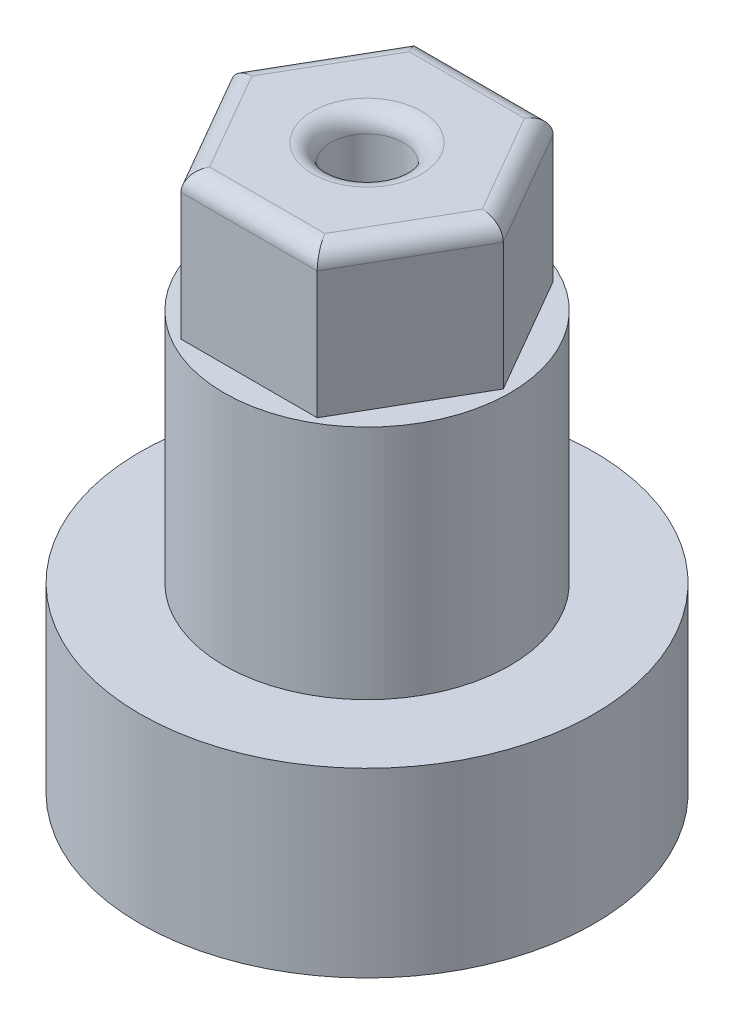
ISO-10303-21;
HEADER;
FILE_DESCRIPTION(('STEP AP214'),'2;1');
FILE_NAME('part.step','',(''),(''),'','','');
FILE_SCHEMA(('AUTOMOTIVE_DESIGN { 1 0 10303 214 1 1 1 1 }'));
ENDSEC;
DATA;
#1=APPLICATION_CONTEXT('core data for automotive mechanical design processes');
#2=APPLICATION_PROTOCOL_DEFINITION('international standard','automotive_design',2000,#1);
#3=PRODUCT_CONTEXT('',#1,'mechanical');
#4=PRODUCT('Part','Part','',(#3));
#5=PRODUCT_RELATED_PRODUCT_CATEGORY('part','',(#4));
#6=PRODUCT_DEFINITION_FORMATION('','',#4);
#7=PRODUCT_DEFINITION_CONTEXT('part definition',#1,'design');
#8=PRODUCT_DEFINITION('design','',#6,#7);
#9=PRODUCT_DEFINITION_SHAPE('','',#8);
#10=(LENGTH_UNIT() NAMED_UNIT(*) SI_UNIT(.MILLI.,.METRE.));
#11=(NAMED_UNIT(*) PLANE_ANGLE_UNIT() SI_UNIT($,.RADIAN.));
#12=(NAMED_UNIT(*) SI_UNIT($,.STERADIAN.) SOLID_ANGLE_UNIT());
#13=UNCERTAINTY_MEASURE_WITH_UNIT(LENGTH_MEASURE(1.E-05),#10,'distance_accuracy_value','');
#14=(GEOMETRIC_REPRESENTATION_CONTEXT(3) GLOBAL_UNCERTAINTY_ASSIGNED_CONTEXT((#13)) GLOBAL_UNIT_ASSIGNED_CONTEXT((#10,
#11,#12)) REPRESENTATION_CONTEXT('',''));
#15=CARTESIAN_POINT('',(0.,0.,0.));
#16=DIRECTION('',(0.,0.,1.));
#17=DIRECTION('',(1.,0.,0.));
#18=AXIS2_PLACEMENT_3D('',#15,#16,#17);
#19=CARTESIAN_POINT('',(0.,10.,0.));
#20=DIRECTION('',(0.,1.,0.));
#21=DIRECTION('',(0.,0.,1.));
#22=AXIS2_PLACEMENT_3D('',#19,#20,#21);
#23=PLANE('',#22);
#24=CARTESIAN_POINT('',(0.,10.,0.));
#25=DIRECTION('',(0.,1.,0.));
#26=DIRECTION('',(0.,0.,1.));
#27=AXIS2_PLACEMENT_3D('',#24,#25,#26);
#28=CIRCLE('',#27,7.875);
#29=CARTESIAN_POINT('',(0.,10.,7.875));
#30=VERTEX_POINT('',#29);
#31=EDGE_CURVE('E147',#30,#30,#28,.T.);
#32=ORIENTED_EDGE('',*,*,#31,.F.);
#33=EDGE_LOOP('',(#32));
#34=FACE_BOUND('',#33,.T.);
#35=CARTESIAN_POINT('',(0.,10.,0.));
#36=DIRECTION('',(0.,1.,0.));
#37=DIRECTION('',(0.,0.,1.));
#38=AXIS2_PLACEMENT_3D('',#35,#36,#37);
#39=CIRCLE('',#38,12.5);
#40=CARTESIAN_POINT('',(0.,10.,12.5));
#41=VERTEX_POINT('',#40);
#42=EDGE_CURVE('E178',#41,#41,#39,.T.);
#43=ORIENTED_EDGE('',*,*,#42,.T.);
#44=EDGE_LOOP('',(#43));
#45=FACE_BOUND('',#44,.T.);
#46=ADVANCED_FACE('F32',(#34,#45),#23,.T.);
#47=CARTESIAN_POINT('',(0.,0.,0.));
#48=DIRECTION('',(0.,1.,0.));
#49=DIRECTION('',(0.,0.,1.));
#50=AXIS2_PLACEMENT_3D('',#47,#48,#49);
#51=PLANE('',#50);
#52=CARTESIAN_POINT('',(0.,0.,0.));
#53=DIRECTION('',(0.,1.,0.));
#54=DIRECTION('',(0.,0.,1.));
#55=AXIS2_PLACEMENT_3D('',#52,#53,#54);
#56=CIRCLE('',#55,2.);
#57=CARTESIAN_POINT('',(0.,0.,2.));
#58=VERTEX_POINT('',#57);
#59=EDGE_CURVE('E128',#58,#58,#56,.T.);
#60=ORIENTED_EDGE('',*,*,#59,.T.);
#61=EDGE_LOOP('',(#60));
#62=FACE_BOUND('',#61,.T.);
#63=CARTESIAN_POINT('',(0.,0.,0.));
#64=DIRECTION('',(0.,1.,0.));
#65=DIRECTION('',(0.,0.,1.));
#66=AXIS2_PLACEMENT_3D('',#63,#64,#65);
#67=CIRCLE('',#66,12.5);
#68=CARTESIAN_POINT('',(0.,0.,12.5));
#69=VERTEX_POINT('',#68);
#70=EDGE_CURVE('E177',#69,#69,#67,.T.);
#71=ORIENTED_EDGE('',*,*,#70,.F.);
#72=EDGE_LOOP('',(#71));
#73=FACE_BOUND('',#72,.T.);
#74=CARTESIAN_POINT('',(7.,0.,0.));
#75=DIRECTION('',(0.,1.,0.));
#76=DIRECTION('',(0.,0.,1.));
#77=AXIS2_PLACEMENT_3D('',#74,#75,#76);
#78=CIRCLE('',#77,0.750000000000001);
#79=CARTESIAN_POINT('',(7.,0.,0.750000000000001));
#80=VERTEX_POINT('',#79);
#81=EDGE_CURVE('E174',#80,#80,#78,.T.);
#82=ORIENTED_EDGE('',*,*,#81,.T.);
#83=EDGE_LOOP('',(#82));
#84=FACE_BOUND('',#83,.T.);
#85=CARTESIAN_POINT('',(0.,0.,7.));
#86=DIRECTION('',(0.,1.,0.));
#87=DIRECTION('',(0.,0.,1.));
#88=AXIS2_PLACEMENT_3D('',#85,#86,#87);
#89=CIRCLE('',#88,0.750000000000001);
#90=CARTESIAN_POINT('',(0.,0.,7.75));
#91=VERTEX_POINT('',#90);
#92=EDGE_CURVE('E171',#91,#91,#89,.T.);
#93=ORIENTED_EDGE('',*,*,#92,.T.);
#94=EDGE_LOOP('',(#93));
#95=FACE_BOUND('',#94,.T.);
#96=CARTESIAN_POINT('',(-7.,0.,0.));
#97=DIRECTION('',(0.,1.,0.));
#98=DIRECTION('',(0.,0.,1.));
#99=AXIS2_PLACEMENT_3D('',#96,#97,#98);
#100=CIRCLE('',#99,0.750000000000001);
#101=CARTESIAN_POINT('',(-7.,0.,0.749999999999952));
#102=VERTEX_POINT('',#101);
#103=EDGE_CURVE('E168',#102,#102,#100,.T.);
#104=ORIENTED_EDGE('',*,*,#103,.T.);
#105=EDGE_LOOP('',(#104));
#106=FACE_BOUND('',#105,.T.);
#107=CARTESIAN_POINT('',(0.,0.,-7.));
#108=DIRECTION('',(0.,1.,0.));
#109=DIRECTION('',(0.,0.,1.));
#110=AXIS2_PLACEMENT_3D('',#107,#108,#109);
#111=CIRCLE('',#110,0.750000000000002);
#112=CARTESIAN_POINT('',(0.,0.,-6.25));
#113=VERTEX_POINT('',#112);
#114=EDGE_CURVE('E165',#113,#113,#111,.T.);
#115=ORIENTED_EDGE('',*,*,#114,.T.);
#116=EDGE_LOOP('',(#115));
#117=FACE_BOUND('',#116,.T.);
#118=ADVANCED_FACE('F230',(#62,#73,#84,#95,#106,#117),#51,.F.);
#119=CARTESIAN_POINT('',(0.,10.,0.));
#120=DIRECTION('',(0.,-1.,0.));
#121=DIRECTION('',(0.,0.,-1.));
#122=AXIS2_PLACEMENT_3D('',#119,#120,#121);
#123=CYLINDRICAL_SURFACE('',#122,12.5);
#124=ORIENTED_EDGE('',*,*,#42,.F.);
#125=EDGE_LOOP('',(#124));
#126=FACE_BOUND('',#125,.T.);
#127=ORIENTED_EDGE('',*,*,#70,.T.);
#128=EDGE_LOOP('',(#127));
#129=FACE_BOUND('',#128,.T.);
#130=ADVANCED_FACE('F254',(#126,#129),#123,.T.);
#131=CARTESIAN_POINT('',(7.,10.,0.));
#132=DIRECTION('',(0.,-1.,0.));
#133=DIRECTION('',(0.,0.,-1.));
#134=AXIS2_PLACEMENT_3D('',#131,#132,#133);
#135=CYLINDRICAL_SURFACE('',#134,0.750000000000001);
#136=CARTESIAN_POINT('',(7.,10.,0.));
#137=DIRECTION('',(0.,1.,0.));
#138=DIRECTION('',(0.,0.,1.));
#139=AXIS2_PLACEMENT_3D('',#136,#137,#138);
#140=CIRCLE('',#139,0.750000000000001);
#141=CARTESIAN_POINT('',(7.,10.,0.750000000000001));
#142=VERTEX_POINT('',#141);
#143=EDGE_CURVE('E162',#142,#142,#140,.T.);
#144=ORIENTED_EDGE('',*,*,#143,.T.);
#145=EDGE_LOOP('',(#144));
#146=FACE_BOUND('',#145,.T.);
#147=ORIENTED_EDGE('',*,*,#81,.F.);
#148=EDGE_LOOP('',(#147));
#149=FACE_BOUND('',#148,.T.);
#150=ADVANCED_FACE('F259',(#146,#149),#135,.F.);
#151=CARTESIAN_POINT('',(0.,10.,7.));
#152=DIRECTION('',(0.,-1.,0.));
#153=DIRECTION('',(0.,0.,-1.));
#154=AXIS2_PLACEMENT_3D('',#151,#152,#153);
#155=CYLINDRICAL_SURFACE('',#154,0.750000000000001);
#156=CARTESIAN_POINT('',(0.,10.,7.));
#157=DIRECTION('',(0.,1.,0.));
#158=DIRECTION('',(0.,0.,1.));
#159=AXIS2_PLACEMENT_3D('',#156,#157,#158);
#160=CIRCLE('',#159,0.750000000000001);
#161=CARTESIAN_POINT('',(0.,10.,7.75));
#162=VERTEX_POINT('',#161);
#163=EDGE_CURVE('E159',#162,#162,#160,.T.);
#164=ORIENTED_EDGE('',*,*,#163,.T.);
#165=EDGE_LOOP('',(#164));
#166=FACE_BOUND('',#165,.T.);
#167=ORIENTED_EDGE('',*,*,#92,.F.);
#168=EDGE_LOOP('',(#167));
#169=FACE_BOUND('',#168,.T.);
#170=ADVANCED_FACE('F449',(#166,#169),#155,.F.);
#171=CARTESIAN_POINT('',(-7.,10.,0.));
#172=DIRECTION('',(0.,-1.,0.));
#173=DIRECTION('',(0.,0.,-1.));
#174=AXIS2_PLACEMENT_3D('',#171,#172,#173);
#175=CYLINDRICAL_SURFACE('',#174,0.750000000000001);
#176=CARTESIAN_POINT('',(-7.,10.,0.));
#177=DIRECTION('',(0.,1.,0.));
#178=DIRECTION('',(0.,0.,1.));
#179=AXIS2_PLACEMENT_3D('',#176,#177,#178);
#180=CIRCLE('',#179,0.750000000000001);
#181=CARTESIAN_POINT('',(-7.,10.,0.749999999999952));
#182=VERTEX_POINT('',#181);
#183=EDGE_CURVE('E156',#182,#182,#180,.T.);
#184=ORIENTED_EDGE('',*,*,#183,.T.);
#185=EDGE_LOOP('',(#184));
#186=FACE_BOUND('',#185,.T.);
#187=ORIENTED_EDGE('',*,*,#103,.F.);
#188=EDGE_LOOP('',(#187));
#189=FACE_BOUND('',#188,.T.);
#190=ADVANCED_FACE('F440',(#186,#189),#175,.F.);
#191=CARTESIAN_POINT('',(0.,10.,-7.));
#192=DIRECTION('',(0.,-1.,0.));
#193=DIRECTION('',(0.,0.,-1.));
#194=AXIS2_PLACEMENT_3D('',#191,#192,#193);
#195=CYLINDRICAL_SURFACE('',#194,0.750000000000002);
#196=CARTESIAN_POINT('',(0.,10.,-7.));
#197=DIRECTION('',(0.,1.,0.));
#198=DIRECTION('',(0.,0.,1.));
#199=AXIS2_PLACEMENT_3D('',#196,#197,#198);
#200=CIRCLE('',#199,0.750000000000002);
#201=CARTESIAN_POINT('',(0.,10.,-6.25));
#202=VERTEX_POINT('',#201);
#203=EDGE_CURVE('E151',#202,#202,#200,.T.);
#204=ORIENTED_EDGE('',*,*,#203,.T.);
#205=EDGE_LOOP('',(#204));
#206=FACE_BOUND('',#205,.T.);
#207=ORIENTED_EDGE('',*,*,#114,.F.);
#208=EDGE_LOOP('',(#207));
#209=FACE_BOUND('',#208,.T.);
#210=ADVANCED_FACE('F432',(#206,#209),#195,.F.);
#211=CARTESIAN_POINT('',(0.,10.,0.));
#212=DIRECTION('',(0.,1.,0.));
#213=DIRECTION('',(0.,0.,1.));
#214=AXIS2_PLACEMENT_3D('',#211,#212,#213);
#215=PLANE('',#214);
#216=ORIENTED_EDGE('',*,*,#203,.F.);
#217=EDGE_LOOP('',(#216));
#218=FACE_BOUND('',#217,.T.);
#219=ADVANCED_FACE('F410',(#218),#215,.F.);
#220=ORIENTED_EDGE('',*,*,#183,.F.);
#221=EDGE_LOOP('',(#220));
#222=FACE_BOUND('',#221,.T.);
#223=ADVANCED_FACE('F417',(#222),#215,.F.);
#224=ORIENTED_EDGE('',*,*,#163,.F.);
#225=EDGE_LOOP('',(#224));
#226=FACE_BOUND('',#225,.T.);
#227=ADVANCED_FACE('F407',(#226),#215,.F.);
#228=ORIENTED_EDGE('',*,*,#143,.F.);
#229=EDGE_LOOP('',(#228));
#230=FACE_BOUND('',#229,.T.);
#231=ADVANCED_FACE('F398',(#230),#215,.F.);
#232=CARTESIAN_POINT('',(0.,23.,0.));
#233=DIRECTION('',(0.,-1.,0.));
#234=DIRECTION('',(0.,0.,-1.));
#235=AXIS2_PLACEMENT_3D('',#232,#233,#234);
#236=CYLINDRICAL_SURFACE('',#235,7.875);
#237=CARTESIAN_POINT('',(0.,23.,0.));
#238=DIRECTION('',(0.,1.,0.));
#239=DIRECTION('',(0.,0.,1.));
#240=AXIS2_PLACEMENT_3D('',#237,#238,#239);
#241=CIRCLE('',#240,7.875);
#242=CARTESIAN_POINT('',(0.,23.,7.875));
#243=VERTEX_POINT('',#242);
#244=EDGE_CURVE('E148',#243,#243,#241,.T.);
#245=ORIENTED_EDGE('',*,*,#244,.F.);
#246=EDGE_LOOP('',(#245));
#247=FACE_BOUND('',#246,.T.);
#248=ORIENTED_EDGE('',*,*,#31,.T.);
#249=EDGE_LOOP('',(#248));
#250=FACE_BOUND('',#249,.T.);
#251=ADVANCED_FACE('F390',(#247,#250),#236,.T.);
#252=CARTESIAN_POINT('',(0.,23.,0.));
#253=DIRECTION('',(0.,1.,0.));
#254=DIRECTION('',(0.,0.,1.));
#255=AXIS2_PLACEMENT_3D('',#252,#253,#254);
#256=PLANE('',#255);
#257=DIRECTION('',(0.499999999999995,0.,-0.866025403784441));
#258=VECTOR('',#257,1.);
#259=CARTESIAN_POINT('',(3.75000000000008,23.,6.49519052838325));
#260=LINE('',#259,#258);
#261=CARTESIAN_POINT('',(3.75000000000008,23.,6.49519052838325));
#262=VERTEX_POINT('',#261);
#263=CARTESIAN_POINT('',(7.5,23.,0.));
#264=VERTEX_POINT('',#263);
#265=EDGE_CURVE('E126',#262,#264,#260,.T.);
#266=ORIENTED_EDGE('',*,*,#265,.F.);
#267=DIRECTION('',(1.,0.,0.));
#268=VECTOR('',#267,1.);
#269=CARTESIAN_POINT('',(-3.74999999999994,23.,6.49519052838332));
#270=LINE('',#269,#268);
#271=CARTESIAN_POINT('',(-3.74999999999994,23.,6.49519052838332));
#272=VERTEX_POINT('',#271);
#273=EDGE_CURVE('E136',#272,#262,#270,.T.);
#274=ORIENTED_EDGE('',*,*,#273,.F.);
#275=DIRECTION('',(0.500000000000007,0.,0.866025403784435));
#276=VECTOR('',#275,1.);
#277=CARTESIAN_POINT('',(-7.5,23.,0.));
#278=LINE('',#277,#276);
#279=CARTESIAN_POINT('',(-7.5,23.,0.));
#280=VERTEX_POINT('',#279);
#281=EDGE_CURVE('E133',#280,#272,#278,.T.);
#282=ORIENTED_EDGE('',*,*,#281,.F.);
#283=DIRECTION('',(-0.499999999999995,0.,0.866025403784442));
#284=VECTOR('',#283,1.);
#285=CARTESIAN_POINT('',(-3.75000000000003,23.,-6.49519052838327));
#286=LINE('',#285,#284);
#287=CARTESIAN_POINT('',(-3.75000000000003,23.,-6.49519052838327));
#288=VERTEX_POINT('',#287);
#289=EDGE_CURVE('E123',#288,#280,#286,.T.);
#290=ORIENTED_EDGE('',*,*,#289,.F.);
#291=DIRECTION('',(-1.,0.,0.));
#292=VECTOR('',#291,1.);
#293=CARTESIAN_POINT('',(3.74999999999998,23.,-6.4951905283833));
#294=LINE('',#293,#292);
#295=CARTESIAN_POINT('',(3.74999999999998,23.,-6.4951905283833));
#296=VERTEX_POINT('',#295);
#297=EDGE_CURVE('E107',#296,#288,#294,.T.);
#298=ORIENTED_EDGE('',*,*,#297,.F.);
#299=DIRECTION('',(-0.500000000000001,0.,-0.866025403784438));
#300=VECTOR('',#299,1.);
#301=CARTESIAN_POINT('',(7.5,23.,0.));
#302=LINE('',#301,#300);
#303=EDGE_CURVE('E119',#264,#296,#302,.T.);
#304=ORIENTED_EDGE('',*,*,#303,.F.);
#305=EDGE_LOOP('',(#266,#274,#282,#290,#298,#304));
#306=FACE_BOUND('',#305,.T.);
#307=ORIENTED_EDGE('',*,*,#244,.T.);
#308=EDGE_LOOP('',(#307));
#309=FACE_BOUND('',#308,.T.);
#310=ADVANCED_FACE('F117',(#306,#309),#256,.T.);
#311=CARTESIAN_POINT('',(3.75000000000008,31.,6.49519052838325));
#312=DIRECTION('',(-0.866025403784441,0.,-0.499999999999995));
#313=DIRECTION('',(-0.499999999999995,0.,0.866025403784442));
#314=AXIS2_PLACEMENT_3D('',#311,#312,#313);
#315=PLANE('',#314);
#316=DIRECTION('',(0.,-1.,0.));
#317=VECTOR('',#316,1.);
#318=CARTESIAN_POINT('',(7.5,31.,0.));
#319=LINE('',#318,#317);
#320=CARTESIAN_POINT('',(7.5,30.,0.));
#321=VERTEX_POINT('',#320);
#322=EDGE_CURVE('E110',#321,#264,#319,.T.);
#323=ORIENTED_EDGE('',*,*,#322,.F.);
#324=DIRECTION('',(0.499999999999995,0.,-0.866025403784442));
#325=VECTOR('',#324,1.);
#326=CARTESIAN_POINT('',(3.75000000000008,30.,6.49519052838325));
#327=LINE('',#326,#325);
#328=CARTESIAN_POINT('',(3.75000000000008,30.,6.49519052838325));
#329=VERTEX_POINT('',#328);
#330=EDGE_CURVE('E41',#321,#329,#327,.F.);
#331=ORIENTED_EDGE('',*,*,#330,.T.);
#332=DIRECTION('',(0.,-1.,0.));
#333=VECTOR('',#332,1.);
#334=CARTESIAN_POINT('',(3.75000000000008,31.,6.49519052838325));
#335=LINE('',#334,#333);
#336=EDGE_CURVE('E139',#329,#262,#335,.T.);
#337=ORIENTED_EDGE('',*,*,#336,.T.);
#338=ORIENTED_EDGE('',*,*,#265,.T.);
#339=EDGE_LOOP('',(#323,#331,#337,#338));
#340=FACE_BOUND('',#339,.T.);
#341=ADVANCED_FACE('F373',(#340),#315,.F.);
#342=CARTESIAN_POINT('',(7.5,31.,0.));
#343=DIRECTION('',(-0.866025403784438,0.,0.500000000000001));
#344=DIRECTION('',(0.500000000000001,0.,0.866025403784438));
#345=AXIS2_PLACEMENT_3D('',#342,#343,#344);
#346=PLANE('',#345);
#347=DIRECTION('',(0.,-1.,0.));
#348=VECTOR('',#347,1.);
#349=CARTESIAN_POINT('',(3.74999999999998,31.,-6.4951905283833));
#350=LINE('',#349,#348);
#351=CARTESIAN_POINT('',(3.74999999999998,30.,-6.4951905283833));
#352=VERTEX_POINT('',#351);
#353=EDGE_CURVE('E104',#352,#296,#350,.T.);
#354=ORIENTED_EDGE('',*,*,#353,.F.);
#355=DIRECTION('',(-0.500000000000001,0.,-0.866025403784438));
#356=VECTOR('',#355,1.);
#357=CARTESIAN_POINT('',(7.5,30.,0.));
#358=LINE('',#357,#356);
#359=EDGE_CURVE('E49',#352,#321,#358,.F.);
#360=ORIENTED_EDGE('',*,*,#359,.T.);
#361=ORIENTED_EDGE('',*,*,#322,.T.);
#362=ORIENTED_EDGE('',*,*,#303,.T.);
#363=EDGE_LOOP('',(#354,#360,#361,#362));
#364=FACE_BOUND('',#363,.T.);
#365=ADVANCED_FACE('F125',(#364),#346,.F.);
#366=CARTESIAN_POINT('',(3.74999999999998,31.,-6.4951905283833));
#367=DIRECTION('',(0.,0.,1.));
#368=DIRECTION('',(1.,0.,0.));
#369=AXIS2_PLACEMENT_3D('',#366,#367,#368);
#370=PLANE('',#369);
#371=DIRECTION('',(0.,-1.,0.));
#372=VECTOR('',#371,1.);
#373=CARTESIAN_POINT('',(-3.75000000000003,31.,-6.49519052838327));
#374=LINE('',#373,#372);
#375=CARTESIAN_POINT('',(-3.75000000000003,30.,-6.49519052838327));
#376=VERTEX_POINT('',#375);
#377=EDGE_CURVE('E111',#376,#288,#374,.T.);
#378=ORIENTED_EDGE('',*,*,#377,.F.);
#379=DIRECTION('',(-1.,0.,0.));
#380=VECTOR('',#379,1.);
#381=CARTESIAN_POINT('',(3.74999999999998,30.,-6.4951905283833));
#382=LINE('',#381,#380);
#383=EDGE_CURVE('E57',#376,#352,#382,.F.);
#384=ORIENTED_EDGE('',*,*,#383,.T.);
#385=ORIENTED_EDGE('',*,*,#353,.T.);
#386=ORIENTED_EDGE('',*,*,#297,.T.);
#387=EDGE_LOOP('',(#378,#384,#385,#386));
#388=FACE_BOUND('',#387,.T.);
#389=ADVANCED_FACE('F106',(#388),#370,.F.);
#390=CARTESIAN_POINT('',(-3.75000000000003,31.,-6.49519052838327));
#391=DIRECTION('',(0.866025403784442,0.,0.499999999999995));
#392=DIRECTION('',(0.499999999999995,0.,-0.866025403784442));
#393=AXIS2_PLACEMENT_3D('',#390,#391,#392);
#394=PLANE('',#393);
#395=DIRECTION('',(0.,-1.,0.));
#396=VECTOR('',#395,1.);
#397=CARTESIAN_POINT('',(-7.5,31.,0.));
#398=LINE('',#397,#396);
#399=CARTESIAN_POINT('',(-7.5,30.,0.));
#400=VERTEX_POINT('',#399);
#401=EDGE_CURVE('E143',#400,#280,#398,.T.);
#402=ORIENTED_EDGE('',*,*,#401,.F.);
#403=DIRECTION('',(-0.499999999999995,0.,0.866025403784442));
#404=VECTOR('',#403,1.);
#405=CARTESIAN_POINT('',(-3.75000000000003,30.,-6.49519052838327));
#406=LINE('',#405,#404);
#407=EDGE_CURVE('E204',#400,#376,#406,.F.);
#408=ORIENTED_EDGE('',*,*,#407,.T.);
#409=ORIENTED_EDGE('',*,*,#377,.T.);
#410=ORIENTED_EDGE('',*,*,#289,.T.);
#411=EDGE_LOOP('',(#402,#408,#409,#410));
#412=FACE_BOUND('',#411,.T.);
#413=ADVANCED_FACE('F349',(#412),#394,.F.);
#414=CARTESIAN_POINT('',(-7.5,31.,0.));
#415=DIRECTION('',(0.866025403784434,0.,-0.500000000000007));
#416=DIRECTION('',(-0.500000000000007,0.,-0.866025403784435));
#417=AXIS2_PLACEMENT_3D('',#414,#415,#416);
#418=PLANE('',#417);
#419=DIRECTION('',(0.,-1.,0.));
#420=VECTOR('',#419,1.);
#421=CARTESIAN_POINT('',(-3.74999999999994,31.,6.49519052838332));
#422=LINE('',#421,#420);
#423=CARTESIAN_POINT('',(-3.74999999999994,30.,6.49519052838332));
#424=VERTEX_POINT('',#423);
#425=EDGE_CURVE('E141',#424,#272,#422,.T.);
#426=ORIENTED_EDGE('',*,*,#425,.F.);
#427=DIRECTION('',(0.500000000000007,0.,0.866025403784435));
#428=VECTOR('',#427,1.);
#429=CARTESIAN_POINT('',(-7.5,30.,0.));
#430=LINE('',#429,#428);
#431=EDGE_CURVE('E202',#424,#400,#430,.F.);
#432=ORIENTED_EDGE('',*,*,#431,.T.);
#433=ORIENTED_EDGE('',*,*,#401,.T.);
#434=ORIENTED_EDGE('',*,*,#281,.T.);
#435=EDGE_LOOP('',(#426,#432,#433,#434));
#436=FACE_BOUND('',#435,.T.);
#437=ADVANCED_FACE('F340',(#436),#418,.F.);
#438=CARTESIAN_POINT('',(-3.74999999999994,31.,6.49519052838332));
#439=DIRECTION('',(0.,0.,-1.));
#440=DIRECTION('',(-1.,0.,0.));
#441=AXIS2_PLACEMENT_3D('',#438,#439,#440);
#442=PLANE('',#441);
#443=ORIENTED_EDGE('',*,*,#336,.F.);
#444=DIRECTION('',(1.,0.,0.));
#445=VECTOR('',#444,1.);
#446=CARTESIAN_POINT('',(-3.74999999999994,30.,6.49519052838332));
#447=LINE('',#446,#445);
#448=EDGE_CURVE('E199',#329,#424,#447,.F.);
#449=ORIENTED_EDGE('',*,*,#448,.T.);
#450=ORIENTED_EDGE('',*,*,#425,.T.);
#451=ORIENTED_EDGE('',*,*,#273,.T.);
#452=EDGE_LOOP('',(#443,#449,#450,#451));
#453=FACE_BOUND('',#452,.T.);
#454=ADVANCED_FACE('F245',(#453),#442,.F.);
#455=CARTESIAN_POINT('',(0.,31.,0.));
#456=DIRECTION('',(0.,1.,0.));
#457=DIRECTION('',(0.,0.,1.));
#458=AXIS2_PLACEMENT_3D('',#455,#456,#457);
#459=PLANE('',#458);
#460=DIRECTION('',(0.500000000000007,0.,0.866025403784435));
#461=VECTOR('',#460,1.);
#462=CARTESIAN_POINT('',(-2.8839745962155,31.,5.99519052838332));
#463=LINE('',#462,#461);
#464=CARTESIAN_POINT('',(-6.34529946162075,31.,0.));
#465=VERTEX_POINT('',#464);
#466=CARTESIAN_POINT('',(-3.17264973081032,31.,5.49519052838332));
#467=VERTEX_POINT('',#466);
#468=EDGE_CURVE('E194',#465,#467,#463,.T.);
#469=ORIENTED_EDGE('',*,*,#468,.T.);
#470=DIRECTION('',(1.,0.,0.));
#471=VECTOR('',#470,1.);
#472=CARTESIAN_POINT('',(3.75000000000007,31.,5.49519052838325));
#473=LINE('',#472,#471);
#474=CARTESIAN_POINT('',(3.17264973081044,31.,5.49519052838325));
#475=VERTEX_POINT('',#474);
#476=EDGE_CURVE('E196',#467,#475,#473,.T.);
#477=ORIENTED_EDGE('',*,*,#476,.T.);
#478=DIRECTION('',(0.499999999999995,0.,-0.866025403784442));
#479=VECTOR('',#478,1.);
#480=CARTESIAN_POINT('',(6.63397459621556,31.,-0.499999999999996));
#481=LINE('',#480,#479);
#482=CARTESIAN_POINT('',(6.34529946162075,31.,0.));
#483=VERTEX_POINT('',#482);
#484=EDGE_CURVE('E186',#475,#483,#481,.T.);
#485=ORIENTED_EDGE('',*,*,#484,.T.);
#486=DIRECTION('',(-0.500000000000001,0.,-0.866025403784438));
#487=VECTOR('',#486,1.);
#488=CARTESIAN_POINT('',(2.88397459621555,31.,-5.9951905283833));
#489=LINE('',#488,#487);
#490=CARTESIAN_POINT('',(3.17264973081036,31.,-5.4951905283833));
#491=VERTEX_POINT('',#490);
#492=EDGE_CURVE('E188',#483,#491,#489,.T.);
#493=ORIENTED_EDGE('',*,*,#492,.T.);
#494=DIRECTION('',(-1.,0.,0.));
#495=VECTOR('',#494,1.);
#496=CARTESIAN_POINT('',(-3.75000000000003,31.,-5.49519052838327));
#497=LINE('',#496,#495);
#498=CARTESIAN_POINT('',(-3.1726497308104,31.,-5.49519052838327));
#499=VERTEX_POINT('',#498);
#500=EDGE_CURVE('E190',#491,#499,#497,.T.);
#501=ORIENTED_EDGE('',*,*,#500,.T.);
#502=DIRECTION('',(-0.499999999999995,0.,0.866025403784442));
#503=VECTOR('',#502,1.);
#504=CARTESIAN_POINT('',(-6.63397459621556,31.,0.500000000000048));
#505=LINE('',#504,#503);
#506=EDGE_CURVE('E192',#499,#465,#505,.T.);
#507=ORIENTED_EDGE('',*,*,#506,.T.);
#508=EDGE_LOOP('',(#469,#477,#485,#493,#501,#507));
#509=FACE_BOUND('',#508,.T.);
#510=CARTESIAN_POINT('',(0.,31.,0.));
#511=DIRECTION('',(0.,1.,0.));
#512=DIRECTION('',(0.,0.,1.));
#513=AXIS2_PLACEMENT_3D('',#510,#511,#512);
#514=CIRCLE('',#513,3.);
#515=CARTESIAN_POINT('',(0.,31.,3.));
#516=VERTEX_POINT('',#515);
#517=EDGE_CURVE('E181',#516,#516,#514,.F.);
#518=ORIENTED_EDGE('',*,*,#517,.T.);
#519=EDGE_LOOP('',(#518));
#520=FACE_BOUND('',#519,.T.);
#521=ADVANCED_FACE('F236',(#509,#520),#459,.T.);
#522=CARTESIAN_POINT('',(0.,0.,0.));
#523=DIRECTION('',(0.,1.,0.));
#524=DIRECTION('',(0.,0.,1.));
#525=AXIS2_PLACEMENT_3D('',#522,#523,#524);
#526=CYLINDRICAL_SURFACE('',#525,2.);
#527=CARTESIAN_POINT('',(0.,30.,0.));
#528=DIRECTION('',(0.,1.,0.));
#529=DIRECTION('',(0.,0.,1.));
#530=AXIS2_PLACEMENT_3D('',#527,#528,#529);
#531=CIRCLE('',#530,2.);
#532=CARTESIAN_POINT('',(0.,30.,2.));
#533=VERTEX_POINT('',#532);
#534=EDGE_CURVE('E11',#533,#533,#531,.T.);
#535=ORIENTED_EDGE('',*,*,#534,.T.);
#536=EDGE_LOOP('',(#535));
#537=FACE_BOUND('',#536,.T.);
#538=ORIENTED_EDGE('',*,*,#59,.F.);
#539=EDGE_LOOP('',(#538));
#540=FACE_BOUND('',#539,.T.);
#541=ADVANCED_FACE('F233',(#537,#540),#526,.F.);
#542=CARTESIAN_POINT('',(0.,30.,-5.49519052838329));
#543=DIRECTION('',(1.,0.,0.));
#544=DIRECTION('',(0.,0.,-1.));
#545=AXIS2_PLACEMENT_3D('',#542,#543,#544);
#546=CYLINDRICAL_SURFACE('',#545,1.);
#547=CARTESIAN_POINT('',(3.17264973081036,30.,-5.4951905283833));
#548=DIRECTION('',(0.86602540378444,0.,0.499999999999998));
#549=DIRECTION('',(-0.499999999999998,0.,0.86602540378444));
#550=AXIS2_PLACEMENT_3D('',#547,#548,#549);
#551=ELLIPSE('',#550,1.15470053837925,1.);
#552=EDGE_CURVE('E218',#352,#491,#551,.T.);
#553=ORIENTED_EDGE('',*,*,#552,.F.);
#554=ORIENTED_EDGE('',*,*,#383,.F.);
#555=CARTESIAN_POINT('',(-3.1726497308104,30.,-5.49519052838327));
#556=DIRECTION('',(0.866025403784436,0.,-0.500000000000004));
#557=DIRECTION('',(0.500000000000004,0.,0.866025403784436));
#558=AXIS2_PLACEMENT_3D('',#555,#556,#557);
#559=ELLIPSE('',#558,1.15470053837925,1.);
#560=EDGE_CURVE('E36',#499,#376,#559,.F.);
#561=ORIENTED_EDGE('',*,*,#560,.F.);
#562=ORIENTED_EDGE('',*,*,#500,.F.);
#563=EDGE_LOOP('',(#553,#554,#561,#562));
#564=FACE_BOUND('',#563,.T.);
#565=ADVANCED_FACE('F235',(#564),#546,.T.);
#566=CARTESIAN_POINT('',(-4.75897459621557,30.,-2.74759526419162));
#567=DIRECTION('',(0.499999999999995,0.,-0.866025403784442));
#568=DIRECTION('',(-0.866025403784442,0.,-0.499999999999995));
#569=AXIS2_PLACEMENT_3D('',#566,#567,#568);
#570=CYLINDRICAL_SURFACE('',#569,1.);
#571=ORIENTED_EDGE('',*,*,#560,.T.);
#572=ORIENTED_EDGE('',*,*,#407,.F.);
#573=CARTESIAN_POINT('',(-6.34529946162075,30.,0.));
#574=DIRECTION('',(0.,0.,-1.));
#575=DIRECTION('',(1.,0.,0.));
#576=AXIS2_PLACEMENT_3D('',#573,#574,#575);
#577=ELLIPSE('',#576,1.15470053837925,1.);
#578=EDGE_CURVE('E216',#465,#400,#577,.F.);
#579=ORIENTED_EDGE('',*,*,#578,.F.);
#580=ORIENTED_EDGE('',*,*,#506,.F.);
#581=EDGE_LOOP('',(#571,#572,#579,#580));
#582=FACE_BOUND('',#581,.T.);
#583=ADVANCED_FACE('F243',(#582),#570,.T.);
#584=CARTESIAN_POINT('',(4.75897459621555,30.,-2.74759526419165));
#585=DIRECTION('',(0.500000000000001,0.,0.866025403784438));
#586=DIRECTION('',(0.866025403784438,0.,-0.500000000000001));
#587=AXIS2_PLACEMENT_3D('',#584,#585,#586);
#588=CYLINDRICAL_SURFACE('',#587,1.);
#589=ORIENTED_EDGE('',*,*,#552,.T.);
#590=ORIENTED_EDGE('',*,*,#492,.F.);
#591=CARTESIAN_POINT('',(6.34529946162075,30.,0.));
#592=DIRECTION('',(0.,0.,1.));
#593=DIRECTION('',(-1.,0.,0.));
#594=AXIS2_PLACEMENT_3D('',#591,#592,#593);
#595=ELLIPSE('',#594,1.15470053837925,1.);
#596=EDGE_CURVE('E213',#321,#483,#595,.T.);
#597=ORIENTED_EDGE('',*,*,#596,.F.);
#598=ORIENTED_EDGE('',*,*,#359,.F.);
#599=EDGE_LOOP('',(#589,#590,#597,#598));
#600=FACE_BOUND('',#599,.T.);
#601=ADVANCED_FACE('F276',(#600),#588,.T.);
#602=CARTESIAN_POINT('',(-4.75897459621553,30.,2.74759526419168));
#603=DIRECTION('',(-0.500000000000007,0.,-0.866025403784435));
#604=DIRECTION('',(-0.866025403784434,0.,0.500000000000007));
#605=AXIS2_PLACEMENT_3D('',#602,#603,#604);
#606=CYLINDRICAL_SURFACE('',#605,1.);
#607=ORIENTED_EDGE('',*,*,#578,.T.);
#608=ORIENTED_EDGE('',*,*,#431,.F.);
#609=CARTESIAN_POINT('',(-3.17264973081032,30.,5.49519052838332));
#610=DIRECTION('',(-0.866025403784443,0.,-0.499999999999992));
#611=DIRECTION('',(0.499999999999992,0.,-0.866025403784443));
#612=AXIS2_PLACEMENT_3D('',#609,#610,#611);
#613=ELLIPSE('',#612,1.15470053837925,1.);
#614=EDGE_CURVE('E211',#467,#424,#613,.F.);
#615=ORIENTED_EDGE('',*,*,#614,.F.);
#616=ORIENTED_EDGE('',*,*,#468,.F.);
#617=EDGE_LOOP('',(#607,#608,#615,#616));
#618=FACE_BOUND('',#617,.T.);
#619=ADVANCED_FACE('F272',(#618),#606,.T.);
#620=CARTESIAN_POINT('',(4.7589745962156,30.,2.74759526419163));
#621=DIRECTION('',(-0.499999999999995,0.,0.866025403784442));
#622=DIRECTION('',(0.866025403784441,0.,0.499999999999995));
#623=AXIS2_PLACEMENT_3D('',#620,#621,#622);
#624=CYLINDRICAL_SURFACE('',#623,1.);
#625=ORIENTED_EDGE('',*,*,#596,.T.);
#626=ORIENTED_EDGE('',*,*,#484,.F.);
#627=CARTESIAN_POINT('',(3.17264973081044,30.,5.49519052838325));
#628=DIRECTION('',(-0.866025403784435,0.,0.500000000000007));
#629=DIRECTION('',(0.500000000000007,0.,0.866025403784435));
#630=AXIS2_PLACEMENT_3D('',#627,#628,#629);
#631=ELLIPSE('',#630,1.15470053837925,1.);
#632=EDGE_CURVE('E209',#329,#475,#631,.T.);
#633=ORIENTED_EDGE('',*,*,#632,.F.);
#634=ORIENTED_EDGE('',*,*,#330,.F.);
#635=EDGE_LOOP('',(#625,#626,#633,#634));
#636=FACE_BOUND('',#635,.T.);
#637=ADVANCED_FACE('F268',(#636),#624,.T.);
#638=CARTESIAN_POINT('',(0.,30.,5.49519052838329));
#639=DIRECTION('',(-1.,0.,0.));
#640=DIRECTION('',(0.,0.,1.));
#641=AXIS2_PLACEMENT_3D('',#638,#639,#640);
#642=CYLINDRICAL_SURFACE('',#641,1.);
#643=ORIENTED_EDGE('',*,*,#614,.T.);
#644=ORIENTED_EDGE('',*,*,#448,.F.);
#645=ORIENTED_EDGE('',*,*,#632,.T.);
#646=ORIENTED_EDGE('',*,*,#476,.F.);
#647=EDGE_LOOP('',(#643,#644,#645,#646));
#648=FACE_BOUND('',#647,.T.);
#649=ADVANCED_FACE('F265',(#648),#642,.T.);
#650=CARTESIAN_POINT('',(0.,30.,0.));
#651=DIRECTION('',(0.,1.,0.));
#652=DIRECTION('',(0.,0.,1.));
#653=AXIS2_PLACEMENT_3D('',#650,#651,#652);
#654=TOROIDAL_SURFACE('',#653,3.,1.);
#655=ORIENTED_EDGE('',*,*,#517,.F.);
#656=EDGE_LOOP('',(#655));
#657=FACE_BOUND('',#656,.T.);
#658=ORIENTED_EDGE('',*,*,#534,.F.);
#659=EDGE_LOOP('',(#658));
#660=FACE_BOUND('',#659,.T.);
#661=ADVANCED_FACE('F34',(#657,#660),#654,.T.);
#662=CLOSED_SHELL('',(#46,#118,#130,#150,#170,#190,#210,#219,#223,#227,#231,#251,#310,#341,#365,
#389,#413,#437,#454,#521,#541,#565,#583,#601,#619,#637,#649,#661));
#663=MANIFOLD_SOLID_BREP('B2',#662);
#664=ADVANCED_BREP_SHAPE_REPRESENTATION('',(#18,#663),#14);
#665=SHAPE_DEFINITION_REPRESENTATION(#9,#664);
ENDSEC;
END-ISO-10303-21;
